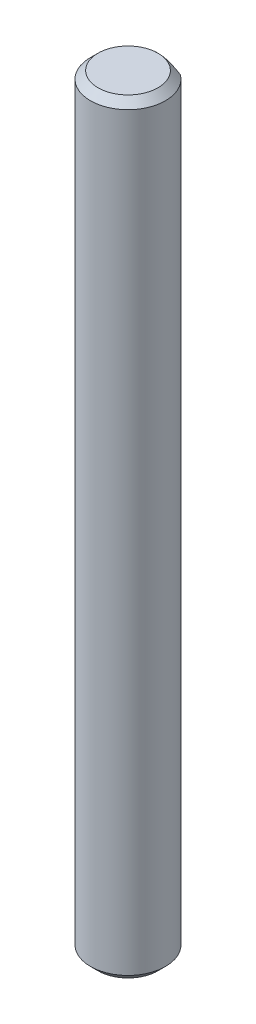
ISO-10303-21;
HEADER;
FILE_DESCRIPTION(('STEP AP214'),'2;1');
FILE_NAME('part.step','',(''),(''),'','','');
FILE_SCHEMA(('AUTOMOTIVE_DESIGN { 1 0 10303 214 1 1 1 1 }'));
ENDSEC;
DATA;
#1=APPLICATION_CONTEXT('core data for automotive mechanical design processes');
#2=APPLICATION_PROTOCOL_DEFINITION('international standard','automotive_design',2000,#1);
#3=PRODUCT_CONTEXT('',#1,'mechanical');
#4=PRODUCT('Part','Part','',(#3));
#5=PRODUCT_RELATED_PRODUCT_CATEGORY('part','',(#4));
#6=PRODUCT_DEFINITION_FORMATION('','',#4);
#7=PRODUCT_DEFINITION_CONTEXT('part definition',#1,'design');
#8=PRODUCT_DEFINITION('design','',#6,#7);
#9=PRODUCT_DEFINITION_SHAPE('','',#8);
#10=(LENGTH_UNIT() NAMED_UNIT(*) SI_UNIT(.MILLI.,.METRE.));
#11=(NAMED_UNIT(*) PLANE_ANGLE_UNIT() SI_UNIT($,.RADIAN.));
#12=(NAMED_UNIT(*) SI_UNIT($,.STERADIAN.) SOLID_ANGLE_UNIT());
#13=UNCERTAINTY_MEASURE_WITH_UNIT(LENGTH_MEASURE(1.E-05),#10,'distance_accuracy_value','');
#14=(GEOMETRIC_REPRESENTATION_CONTEXT(3) GLOBAL_UNCERTAINTY_ASSIGNED_CONTEXT((#13)) GLOBAL_UNIT_ASSIGNED_CONTEXT((#10,
#11,#12)) REPRESENTATION_CONTEXT('',''));
#15=CARTESIAN_POINT('',(0.,0.,0.));
#16=DIRECTION('',(0.,0.,1.));
#17=DIRECTION('',(1.,0.,0.));
#18=AXIS2_PLACEMENT_3D('',#15,#16,#17);
#19=CARTESIAN_POINT('',(0.,51.,0.));
#20=DIRECTION('',(0.,-1.,0.));
#21=DIRECTION('',(0.,0.,-1.));
#22=AXIS2_PLACEMENT_3D('',#19,#20,#21);
#23=CYLINDRICAL_SURFACE('',#22,2.5);
#24=CARTESIAN_POINT('',(0.,0.499999999999994,0.));
#25=DIRECTION('',(0.,1.,0.));
#26=DIRECTION('',(0.,0.,1.));
#27=AXIS2_PLACEMENT_3D('',#24,#25,#26);
#28=CIRCLE('',#27,2.5);
#29=CARTESIAN_POINT('',(0.,0.499999999999994,2.5));
#30=VERTEX_POINT('',#29);
#31=EDGE_CURVE('E87',#30,#30,#28,.T.);
#32=ORIENTED_EDGE('',*,*,#31,.T.);
#33=EDGE_LOOP('',(#32));
#34=FACE_BOUND('',#33,.T.);
#35=DIRECTION('',(0.,1.,0.));
#36=VECTOR('',#35,1.);
#37=CARTESIAN_POINT('',(1.5,36.,-2.));
#38=LINE('',#37,#36);
#39=CARTESIAN_POINT('',(1.5,36.,-2.));
#40=VERTEX_POINT('',#39);
#41=CARTESIAN_POINT('',(1.5,50.5,-2.));
#42=VERTEX_POINT('',#41);
#43=EDGE_CURVE('E80',#40,#42,#38,.T.);
#44=ORIENTED_EDGE('',*,*,#43,.T.);
#45=CARTESIAN_POINT('',(0.,50.5,0.));
#46=DIRECTION('',(0.,1.,0.));
#47=DIRECTION('',(0.,0.,1.));
#48=AXIS2_PLACEMENT_3D('',#45,#46,#47);
#49=CIRCLE('',#48,2.5);
#50=CARTESIAN_POINT('',(-1.5,50.5,-2.));
#51=VERTEX_POINT('',#50);
#52=EDGE_CURVE('E82',#42,#51,#49,.F.);
#53=ORIENTED_EDGE('',*,*,#52,.T.);
#54=DIRECTION('',(0.,1.,0.));
#55=VECTOR('',#54,1.);
#56=CARTESIAN_POINT('',(-1.5,36.,-2.));
#57=LINE('',#56,#55);
#58=CARTESIAN_POINT('',(-1.5,36.,-2.));
#59=VERTEX_POINT('',#58);
#60=EDGE_CURVE('E78',#59,#51,#57,.T.);
#61=ORIENTED_EDGE('',*,*,#60,.F.);
#62=CARTESIAN_POINT('',(0.,36.,0.));
#63=DIRECTION('',(0.,1.,0.));
#64=DIRECTION('',(0.,0.,1.));
#65=AXIS2_PLACEMENT_3D('',#62,#63,#64);
#66=CIRCLE('',#65,2.5);
#67=EDGE_CURVE('E69',#40,#59,#66,.T.);
#68=ORIENTED_EDGE('',*,*,#67,.F.);
#69=EDGE_LOOP('',(#44,#53,#61,#68));
#70=FACE_BOUND('',#69,.T.);
#71=ADVANCED_FACE('F34',(#34,#70),#23,.T.);
#72=CARTESIAN_POINT('',(0.,51.,0.));
#73=DIRECTION('',(0.,1.,0.));
#74=DIRECTION('',(0.,0.,1.));
#75=AXIS2_PLACEMENT_3D('',#72,#73,#74);
#76=PLANE('',#75);
#77=CARTESIAN_POINT('',(0.,51.,0.));
#78=DIRECTION('',(0.,1.,0.));
#79=DIRECTION('',(0.,0.,1.));
#80=AXIS2_PLACEMENT_3D('',#77,#78,#79);
#81=CIRCLE('',#80,1.99999999999999);
#82=CARTESIAN_POINT('',(0.,51.,-2.));
#83=VERTEX_POINT('',#82);
#84=EDGE_CURVE('E93',#83,#83,#81,.T.);
#85=ORIENTED_EDGE('',*,*,#84,.T.);
#86=EDGE_LOOP('',(#85));
#87=FACE_BOUND('',#86,.T.);
#88=ADVANCED_FACE('F104',(#87),#76,.T.);
#89=CARTESIAN_POINT('',(0.,0.,0.));
#90=DIRECTION('',(0.,1.,0.));
#91=DIRECTION('',(0.,0.,1.));
#92=AXIS2_PLACEMENT_3D('',#89,#90,#91);
#93=PLANE('',#92);
#94=CARTESIAN_POINT('',(0.,0.,0.));
#95=DIRECTION('',(0.,1.,0.));
#96=DIRECTION('',(0.,0.,1.));
#97=AXIS2_PLACEMENT_3D('',#94,#95,#96);
#98=CIRCLE('',#97,1.99999999999999);
#99=CARTESIAN_POINT('',(0.,0.,1.99999999999999));
#100=VERTEX_POINT('',#99);
#101=EDGE_CURVE('E90',#100,#100,#98,.F.);
#102=ORIENTED_EDGE('',*,*,#101,.T.);
#103=EDGE_LOOP('',(#102));
#104=FACE_BOUND('',#103,.T.);
#105=ADVANCED_FACE('F103',(#104),#93,.F.);
#106=CARTESIAN_POINT('',(-1.5,36.,-2.));
#107=DIRECTION('',(0.,0.,1.));
#108=DIRECTION('',(1.,0.,0.));
#109=AXIS2_PLACEMENT_3D('',#106,#107,#108);
#110=PLANE('',#109);
#111=CARTESIAN_POINT('',(-1.5,50.5,-2.));
#112=CARTESIAN_POINT('',(-1.42763018659214,50.5433736980276,-2.));
#113=CARTESIAN_POINT('',(-1.35436226532258,50.5853687019536,-2.));
#114=CARTESIAN_POINT('',(-1.20549660628809,50.6656443583189,-2.));
#115=CARTESIAN_POINT('',(-1.12989157710705,50.7039114197061,-2.));
#116=CARTESIAN_POINT('',(-0.978296734874827,50.774534191742,-2.));
#117=CARTESIAN_POINT('',(-0.902366736266404,50.8070165390548,-2.));
#118=CARTESIAN_POINT('',(-0.748220644904071,50.8658090166989,-2.));
#119=CARTESIAN_POINT('',(-0.670007876047703,50.8921276624893,-2.));
#120=CARTESIAN_POINT('',(-0.543060600019242,50.9280861032667,-2.));
#121=CARTESIAN_POINT('',(-0.495021163503639,50.9401901027996,-2.));
#122=CARTESIAN_POINT('',(-0.398260419217579,50.9612794306282,-2.));
#123=CARTESIAN_POINT('',(-0.349539198139852,50.9702651517484,-2.));
#124=CARTESIAN_POINT('',(-0.250852177401956,50.984927124024,-2.));
#125=CARTESIAN_POINT('',(-0.200878654038627,50.9905520018212,-2.));
#126=CARTESIAN_POINT('',(-0.100607619276169,50.9981023484678,-2.));
#127=CARTESIAN_POINT('',(-0.0503098472705245,51.0000243314446,-2.));
#128=CARTESIAN_POINT('',(0.,51.,-2.));
#129=B_SPLINE_CURVE_WITH_KNOTS('',3,(#111,#112,#113,#114,#115,#116,#117,#118,#119,#120,#121,
#122,#123,#124,#125,#126,#127,#128),.UNSPECIFIED.,.F.,.F.,(4,2,2,2,2,2,2,2,4),(0.,
0.2531950346956,0.50728107597429,0.754837752612878,1.00205037282501,1.15058504578388,
1.29910100031797,1.44983263801686,1.600706103947),.UNSPECIFIED.);
#130=EDGE_CURVE('E48',#51,#83,#129,.T.);
#131=ORIENTED_EDGE('',*,*,#130,.T.);
#132=CARTESIAN_POINT('',(0.,51.,-1.99999999999999));
#133=CARTESIAN_POINT('',(0.0614966481035616,51.0000514930087,-2.));
#134=CARTESIAN_POINT('',(0.122961796118779,50.997164788165,-2.));
#135=CARTESIAN_POINT('',(0.245274670057057,50.9859212389057,-2.));
#136=CARTESIAN_POINT('',(0.306123362775477,50.9775750221521,-2.));
#137=CARTESIAN_POINT('',(0.425885509906891,50.9559969816614,-2.));
#138=CARTESIAN_POINT('',(0.484814317272308,50.9428488248966,-2.));
#139=CARTESIAN_POINT('',(0.601555526074533,50.9122507618696,-2.));
#140=CARTESIAN_POINT('',(0.659367456410754,50.8947990813251,-2.));
#141=CARTESIAN_POINT('',(0.784576263433312,50.8525702057821,-2.));
#142=CARTESIAN_POINT('',(0.851714510760655,50.8270315815753,-2.));
#143=CARTESIAN_POINT('',(0.984250024576912,50.7717452055524,-2.));
#144=CARTESIAN_POINT('',(1.04964642506795,50.7419954048129,-2.));
#145=CARTESIAN_POINT('',(1.18016546542206,50.6784785026746,-2.));
#146=CARTESIAN_POINT('',(1.24525271545219,50.6446394298057,-2.));
#147=CARTESIAN_POINT('',(1.37378197006118,50.5742160914667,-2.));
#148=CARTESIAN_POINT('',(1.43722666174302,50.5376367483736,-2.));
#149=CARTESIAN_POINT('',(1.5,50.5,-2.));
#150=B_SPLINE_CURVE_WITH_KNOTS('',3,(#132,#133,#134,#135,#136,#137,#138,#139,#140,#141,#142,
#143,#144,#145,#146,#147,#148,#149),.UNSPECIFIED.,.F.,.F.,(4,2,2,2,2,2,2,2,4),(0.,
0.184371949240824,0.368386057907036,0.549336051664293,0.730360773654886,0.94567404487139,
1.16109243790835,1.38109142427279,1.60070428639642),.UNSPECIFIED.);
#151=EDGE_CURVE('E11',#83,#42,#150,.T.);
#152=ORIENTED_EDGE('',*,*,#151,.T.);
#153=ORIENTED_EDGE('',*,*,#43,.F.);
#154=DIRECTION('',(1.,0.,0.));
#155=VECTOR('',#154,1.);
#156=CARTESIAN_POINT('',(-1.5,36.,-2.));
#157=LINE('',#156,#155);
#158=EDGE_CURVE('E72',#59,#40,#157,.T.);
#159=ORIENTED_EDGE('',*,*,#158,.F.);
#160=ORIENTED_EDGE('',*,*,#60,.T.);
#161=EDGE_LOOP('',(#131,#152,#153,#159,#160));
#162=FACE_BOUND('',#161,.T.);
#163=ADVANCED_FACE('F77',(#162),#110,.F.);
#164=CARTESIAN_POINT('',(0.,36.,0.));
#165=DIRECTION('',(0.,1.,0.));
#166=DIRECTION('',(0.,0.,1.));
#167=AXIS2_PLACEMENT_3D('',#164,#165,#166);
#168=PLANE('',#167);
#169=ORIENTED_EDGE('',*,*,#67,.T.);
#170=ORIENTED_EDGE('',*,*,#158,.T.);
#171=EDGE_LOOP('',(#169,#170));
#172=FACE_BOUND('',#171,.T.);
#173=ADVANCED_FACE('F71',(#172),#168,.T.);
#174=CARTESIAN_POINT('',(0.,0.499999999999994,0.));
#175=DIRECTION('',(0.,1.,0.));
#176=DIRECTION('',(0.,0.,1.));
#177=AXIS2_PLACEMENT_3D('',#174,#175,#176);
#178=CONICAL_SURFACE('',#177,2.5,0.78539816339746);
#179=ORIENTED_EDGE('',*,*,#101,.F.);
#180=EDGE_LOOP('',(#179));
#181=FACE_BOUND('',#180,.T.);
#182=ORIENTED_EDGE('',*,*,#31,.F.);
#183=EDGE_LOOP('',(#182));
#184=FACE_BOUND('',#183,.T.);
#185=ADVANCED_FACE('F114',(#181,#184),#178,.T.);
#186=CARTESIAN_POINT('',(0.,51.,0.));
#187=DIRECTION('',(0.,-1.,0.));
#188=DIRECTION('',(0.,0.,-1.));
#189=AXIS2_PLACEMENT_3D('',#186,#187,#188);
#190=CONICAL_SURFACE('',#189,1.99999999999999,0.785398163397446);
#191=ORIENTED_EDGE('',*,*,#130,.F.);
#192=ORIENTED_EDGE('',*,*,#52,.F.);
#193=ORIENTED_EDGE('',*,*,#151,.F.);
#194=ORIENTED_EDGE('',*,*,#84,.F.);
#195=EDGE_LOOP('',(#191,#192,#193,#194));
#196=FACE_BOUND('',#195,.T.);
#197=ADVANCED_FACE('F36',(#196),#190,.T.);
#198=CLOSED_SHELL('',(#71,#88,#105,#163,#173,#185,#197));
#199=MANIFOLD_SOLID_BREP('B2',#198);
#200=ADVANCED_BREP_SHAPE_REPRESENTATION('',(#18,#199),#14);
#201=SHAPE_DEFINITION_REPRESENTATION(#9,#200);
ENDSEC;
END-ISO-10303-21;
